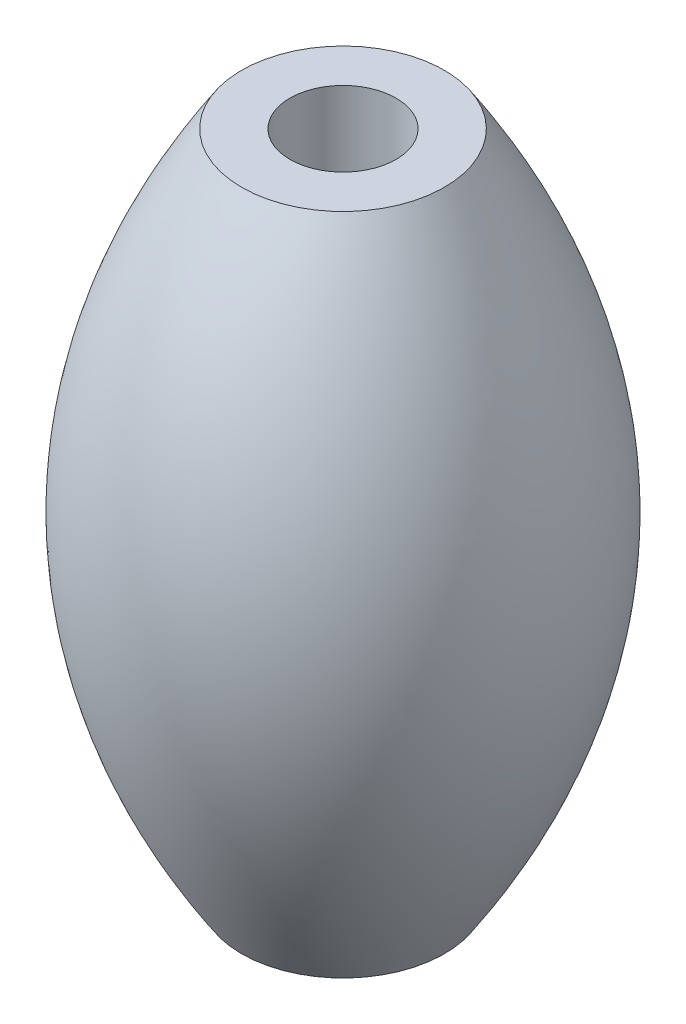
ISO-10303-21;
HEADER;
FILE_DESCRIPTION(('STEP AP214'),'2;1');
FILE_NAME('part.step','',(''),(''),'','','');
FILE_SCHEMA(('AUTOMOTIVE_DESIGN { 1 0 10303 214 1 1 1 1 }'));
ENDSEC;
DATA;
#1=APPLICATION_CONTEXT('core data for automotive mechanical design processes');
#2=APPLICATION_PROTOCOL_DEFINITION('international standard','automotive_design',2000,#1);
#3=PRODUCT_CONTEXT('',#1,'mechanical');
#4=PRODUCT('Part','Part','',(#3));
#5=PRODUCT_RELATED_PRODUCT_CATEGORY('part','',(#4));
#6=PRODUCT_DEFINITION_FORMATION('','',#4);
#7=PRODUCT_DEFINITION_CONTEXT('part definition',#1,'design');
#8=PRODUCT_DEFINITION('design','',#6,#7);
#9=PRODUCT_DEFINITION_SHAPE('','',#8);
#10=(LENGTH_UNIT() NAMED_UNIT(*) SI_UNIT(.MILLI.,.METRE.));
#11=(NAMED_UNIT(*) PLANE_ANGLE_UNIT() SI_UNIT($,.RADIAN.));
#12=(NAMED_UNIT(*) SI_UNIT($,.STERADIAN.) SOLID_ANGLE_UNIT());
#13=UNCERTAINTY_MEASURE_WITH_UNIT(LENGTH_MEASURE(1.E-05),#10,'distance_accuracy_value','');
#14=(GEOMETRIC_REPRESENTATION_CONTEXT(3) GLOBAL_UNCERTAINTY_ASSIGNED_CONTEXT((#13)) GLOBAL_UNIT_ASSIGNED_CONTEXT((#10,
#11,#12)) REPRESENTATION_CONTEXT('',''));
#15=CARTESIAN_POINT('',(0.,0.,0.));
#16=DIRECTION('',(0.,0.,1.));
#17=DIRECTION('',(1.,0.,0.));
#18=AXIS2_PLACEMENT_3D('',#15,#16,#17);
#19=CARTESIAN_POINT('',(2.2,-13.75,0.));
#20=DIRECTION('',(0.,1.,0.));
#21=DIRECTION('',(0.,0.,1.));
#22=AXIS2_PLACEMENT_3D('',#19,#20,#21);
#23=PLANE('',#22);
#24=CARTESIAN_POINT('',(0.,-13.75,0.));
#25=DIRECTION('',(0.,1.,0.));
#26=DIRECTION('',(0.,0.,1.));
#27=AXIS2_PLACEMENT_3D('',#24,#25,#26);
#28=CIRCLE('',#27,4.2);
#29=CARTESIAN_POINT('',(0.,-13.75,4.2));
#30=VERTEX_POINT('',#29);
#31=EDGE_CURVE('E36',#30,#30,#28,.T.);
#32=ORIENTED_EDGE('',*,*,#31,.F.);
#33=EDGE_LOOP('',(#32));
#34=FACE_BOUND('',#33,.T.);
#35=CARTESIAN_POINT('',(0.,-13.75,0.));
#36=DIRECTION('',(0.,1.,0.));
#37=DIRECTION('',(0.,0.,1.));
#38=AXIS2_PLACEMENT_3D('',#35,#36,#37);
#39=CIRCLE('',#38,2.2);
#40=CARTESIAN_POINT('',(0.,-13.75,2.2));
#41=VERTEX_POINT('',#40);
#42=EDGE_CURVE('E10',#41,#41,#39,.T.);
#43=ORIENTED_EDGE('',*,*,#42,.T.);
#44=EDGE_LOOP('',(#43));
#45=FACE_BOUND('',#44,.T.);
#46=ADVANCED_FACE('F30',(#34,#45),#23,.F.);
#47=CARTESIAN_POINT('',(4.2,-13.75,0.));
#48=CARTESIAN_POINT('',(13.2,0.,0.));
#49=CARTESIAN_POINT('',(4.2,13.75,0.));
#50=B_SPLINE_CURVE_WITH_KNOTS('',2,(#47,#48,#49),.UNSPECIFIED.,.F.,.F.,(3,3),(0.,1.),.UNSPECIFIED.);
#51=CARTESIAN_POINT('',(0.,36.0000427348456,0.));
#52=DIRECTION('',(0.,1.,0.));
#53=AXIS1_PLACEMENT('',#51,#52);
#54=SURFACE_OF_REVOLUTION('',#50,#53);
#55=CARTESIAN_POINT('',(0.,13.75,0.));
#56=DIRECTION('',(0.,1.,0.));
#57=DIRECTION('',(0.,0.,1.));
#58=AXIS2_PLACEMENT_3D('',#55,#56,#57);
#59=CIRCLE('',#58,4.2);
#60=CARTESIAN_POINT('',(0.,13.75,4.2));
#61=VERTEX_POINT('',#60);
#62=EDGE_CURVE('E40',#61,#61,#59,.T.);
#63=ORIENTED_EDGE('',*,*,#62,.F.);
#64=EDGE_LOOP('',(#63));
#65=FACE_BOUND('',#64,.T.);
#66=ORIENTED_EDGE('',*,*,#31,.T.);
#67=EDGE_LOOP('',(#66));
#68=FACE_BOUND('',#67,.T.);
#69=ADVANCED_FACE('F55',(#65,#68),#54,.T.);
#70=CARTESIAN_POINT('',(2.2,13.75,0.));
#71=DIRECTION('',(0.,-1.,0.));
#72=DIRECTION('',(0.,0.,-1.));
#73=AXIS2_PLACEMENT_3D('',#70,#71,#72);
#74=PLANE('',#73);
#75=CARTESIAN_POINT('',(0.,13.75,0.));
#76=DIRECTION('',(0.,1.,0.));
#77=DIRECTION('',(0.,0.,1.));
#78=AXIS2_PLACEMENT_3D('',#75,#76,#77);
#79=CIRCLE('',#78,2.2);
#80=CARTESIAN_POINT('',(0.,13.75,2.2));
#81=VERTEX_POINT('',#80);
#82=EDGE_CURVE('E44',#81,#81,#79,.T.);
#83=ORIENTED_EDGE('',*,*,#82,.F.);
#84=EDGE_LOOP('',(#83));
#85=FACE_BOUND('',#84,.T.);
#86=ORIENTED_EDGE('',*,*,#62,.T.);
#87=EDGE_LOOP('',(#86));
#88=FACE_BOUND('',#87,.T.);
#89=ADVANCED_FACE('F58',(#85,#88),#74,.F.);
#90=CARTESIAN_POINT('',(0.,36.0000427348456,0.));
#91=DIRECTION('',(0.,1.,0.));
#92=DIRECTION('',(0.,0.,1.));
#93=AXIS2_PLACEMENT_3D('',#90,#91,#92);
#94=CYLINDRICAL_SURFACE('',#93,2.2);
#95=ORIENTED_EDGE('',*,*,#42,.F.);
#96=EDGE_LOOP('',(#95));
#97=FACE_BOUND('',#96,.T.);
#98=ORIENTED_EDGE('',*,*,#82,.T.);
#99=EDGE_LOOP('',(#98));
#100=FACE_BOUND('',#99,.T.);
#101=ADVANCED_FACE('F62',(#97,#100),#94,.F.);
#102=CLOSED_SHELL('',(#46,#69,#89,#101));
#103=MANIFOLD_SOLID_BREP('B2',#102);
#104=ADVANCED_BREP_SHAPE_REPRESENTATION('',(#18,#103),#14);
#105=SHAPE_DEFINITION_REPRESENTATION(#9,#104);
ENDSEC;
END-ISO-10303-21;
